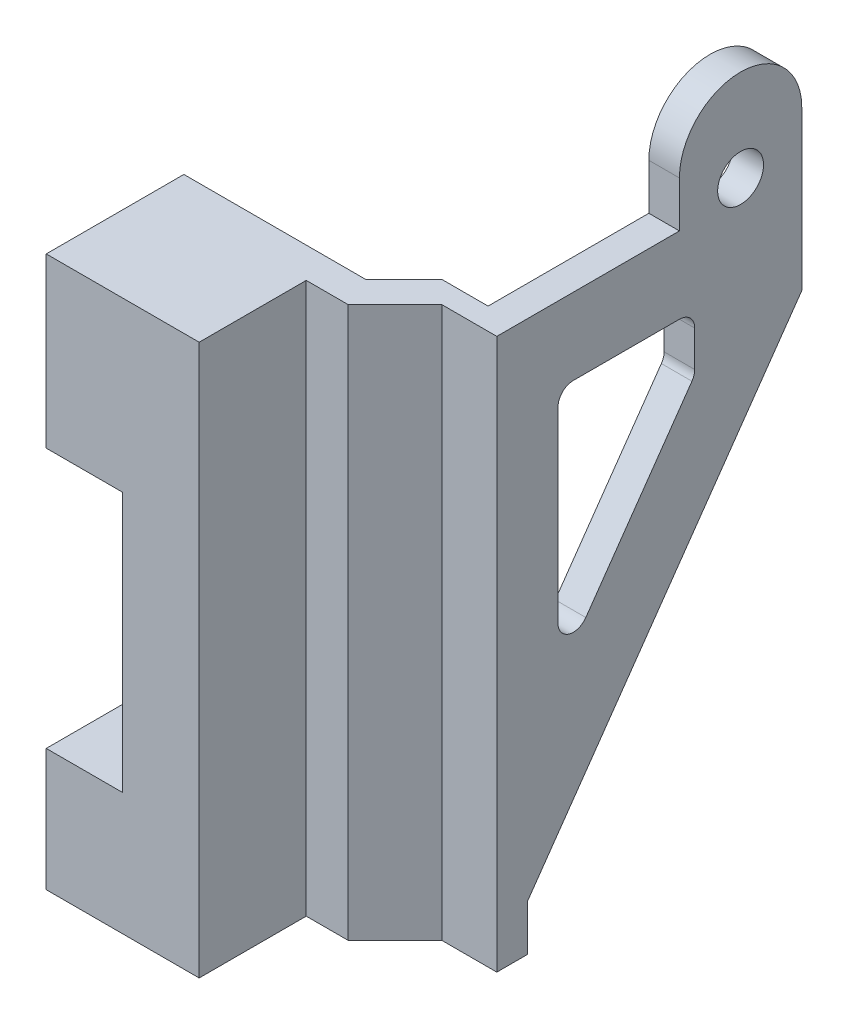
ISO-10303-21;
HEADER;
FILE_DESCRIPTION(('STEP AP214'),'2;1');
FILE_NAME('part.step','',(''),(''),'','','');
FILE_SCHEMA(('AUTOMOTIVE_DESIGN { 1 0 10303 214 1 1 1 1 }'));
ENDSEC;
DATA;
#1=APPLICATION_CONTEXT('core data for automotive mechanical design processes');
#2=APPLICATION_PROTOCOL_DEFINITION('international standard','automotive_design',2000,#1);
#3=PRODUCT_CONTEXT('',#1,'mechanical');
#4=PRODUCT('Part','Part','',(#3));
#5=PRODUCT_RELATED_PRODUCT_CATEGORY('part','',(#4));
#6=PRODUCT_DEFINITION_FORMATION('','',#4);
#7=PRODUCT_DEFINITION_CONTEXT('part definition',#1,'design');
#8=PRODUCT_DEFINITION('design','',#6,#7);
#9=PRODUCT_DEFINITION_SHAPE('','',#8);
#10=(LENGTH_UNIT() NAMED_UNIT(*) SI_UNIT(.MILLI.,.METRE.));
#11=(NAMED_UNIT(*) PLANE_ANGLE_UNIT() SI_UNIT($,.RADIAN.));
#12=(NAMED_UNIT(*) SI_UNIT($,.STERADIAN.) SOLID_ANGLE_UNIT());
#13=UNCERTAINTY_MEASURE_WITH_UNIT(LENGTH_MEASURE(1.E-05),#10,'distance_accuracy_value','');
#14=(GEOMETRIC_REPRESENTATION_CONTEXT(3) GLOBAL_UNCERTAINTY_ASSIGNED_CONTEXT((#13)) GLOBAL_UNIT_ASSIGNED_CONTEXT((#10,
#11,#12)) REPRESENTATION_CONTEXT('',''));
#15=CARTESIAN_POINT('',(0.,0.,0.));
#16=DIRECTION('',(0.,0.,1.));
#17=DIRECTION('',(1.,0.,0.));
#18=AXIS2_PLACEMENT_3D('',#15,#16,#17);
#19=CARTESIAN_POINT('',(0.,36.,0.));
#20=DIRECTION('',(1.,0.,0.));
#21=DIRECTION('',(0.,0.,-1.));
#22=AXIS2_PLACEMENT_3D('',#19,#20,#21);
#23=PLANE('',#22);
#24=DIRECTION('',(0.,-1.,0.));
#25=VECTOR('',#24,1.);
#26=CARTESIAN_POINT('',(0.,36.,9.));
#27=LINE('',#26,#25);
#28=CARTESIAN_POINT('',(0.,8.,9.));
#29=VERTEX_POINT('',#28);
#30=CARTESIAN_POINT('',(0.,0.,9.));
#31=VERTEX_POINT('',#30);
#32=EDGE_CURVE('E45',#29,#31,#27,.T.);
#33=ORIENTED_EDGE('',*,*,#32,.F.);
#34=DIRECTION('',(0.,0.,-1.));
#35=VECTOR('',#34,1.);
#36=CARTESIAN_POINT('',(0.,8.,9.001));
#37=LINE('',#36,#35);
#38=CARTESIAN_POINT('',(0.,8.,0.));
#39=VERTEX_POINT('',#38);
#40=EDGE_CURVE('E228',#29,#39,#37,.T.);
#41=ORIENTED_EDGE('',*,*,#40,.T.);
#42=DIRECTION('',(0.,-1.,0.));
#43=VECTOR('',#42,1.);
#44=CARTESIAN_POINT('',(0.,36.,0.));
#45=LINE('',#44,#43);
#46=CARTESIAN_POINT('',(0.,0.,0.));
#47=VERTEX_POINT('',#46);
#48=EDGE_CURVE('E276',#39,#47,#45,.T.);
#49=ORIENTED_EDGE('',*,*,#48,.T.);
#50=DIRECTION('',(0.,0.,1.));
#51=VECTOR('',#50,1.);
#52=CARTESIAN_POINT('',(0.,0.,0.));
#53=LINE('',#52,#51);
#54=EDGE_CURVE('E277',#47,#31,#53,.T.);
#55=ORIENTED_EDGE('',*,*,#54,.T.);
#56=EDGE_LOOP('',(#33,#41,#49,#55));
#57=FACE_BOUND('',#56,.T.);
#58=ADVANCED_FACE('F37',(#57),#23,.F.);
#59=CARTESIAN_POINT('',(0.,36.,0.));
#60=VERTEX_POINT('',#59);
#61=CARTESIAN_POINT('',(0.,25.,0.));
#62=VERTEX_POINT('',#61);
#63=EDGE_CURVE('E235',#60,#62,#45,.T.);
#64=ORIENTED_EDGE('',*,*,#63,.T.);
#65=DIRECTION('',(0.,0.,-1.));
#66=VECTOR('',#65,1.);
#67=CARTESIAN_POINT('',(0.,25.,9.001));
#68=LINE('',#67,#66);
#69=CARTESIAN_POINT('',(0.,25.,9.));
#70=VERTEX_POINT('',#69);
#71=EDGE_CURVE('E52',#70,#62,#68,.T.);
#72=ORIENTED_EDGE('',*,*,#71,.F.);
#73=CARTESIAN_POINT('',(0.,36.,9.));
#74=VERTEX_POINT('',#73);
#75=EDGE_CURVE('E11',#74,#70,#27,.T.);
#76=ORIENTED_EDGE('',*,*,#75,.F.);
#77=DIRECTION('',(0.,0.,1.));
#78=VECTOR('',#77,1.);
#79=CARTESIAN_POINT('',(0.,36.,0.));
#80=LINE('',#79,#78);
#81=EDGE_CURVE('E246',#60,#74,#80,.T.);
#82=ORIENTED_EDGE('',*,*,#81,.F.);
#83=EDGE_LOOP('',(#64,#72,#76,#82));
#84=FACE_BOUND('',#83,.T.);
#85=ADVANCED_FACE('F39',(#84),#23,.F.);
#86=CARTESIAN_POINT('',(0.,36.,9.));
#87=DIRECTION('',(0.,0.,-1.));
#88=DIRECTION('',(-1.,0.,0.));
#89=AXIS2_PLACEMENT_3D('',#86,#87,#88);
#90=PLANE('',#89);
#91=DIRECTION('',(0.,1.,0.));
#92=VECTOR('',#91,1.);
#93=CARTESIAN_POINT('',(5.,8.,9.));
#94=LINE('',#93,#92);
#95=CARTESIAN_POINT('',(5.,8.,9.));
#96=VERTEX_POINT('',#95);
#97=CARTESIAN_POINT('',(5.,25.,9.));
#98=VERTEX_POINT('',#97);
#99=EDGE_CURVE('E508',#96,#98,#94,.T.);
#100=ORIENTED_EDGE('',*,*,#99,.F.);
#101=DIRECTION('',(1.,0.,0.));
#102=VECTOR('',#101,1.);
#103=CARTESIAN_POINT('',(0.,8.,9.));
#104=LINE('',#103,#102);
#105=EDGE_CURVE('E332',#29,#96,#104,.T.);
#106=ORIENTED_EDGE('',*,*,#105,.F.);
#107=ORIENTED_EDGE('',*,*,#32,.T.);
#108=DIRECTION('',(1.,0.,0.));
#109=VECTOR('',#108,1.);
#110=CARTESIAN_POINT('',(0.,0.,9.));
#111=LINE('',#110,#109);
#112=CARTESIAN_POINT('',(10.,0.,9.));
#113=VERTEX_POINT('',#112);
#114=EDGE_CURVE('E280',#31,#113,#111,.T.);
#115=ORIENTED_EDGE('',*,*,#114,.T.);
#116=DIRECTION('',(0.,-1.,0.));
#117=VECTOR('',#116,1.);
#118=CARTESIAN_POINT('',(10.,36.,9.));
#119=LINE('',#118,#117);
#120=CARTESIAN_POINT('',(10.,36.,9.));
#121=VERTEX_POINT('',#120);
#122=EDGE_CURVE('E243',#121,#113,#119,.T.);
#123=ORIENTED_EDGE('',*,*,#122,.F.);
#124=DIRECTION('',(1.,0.,0.));
#125=VECTOR('',#124,1.);
#126=CARTESIAN_POINT('',(0.,36.,9.));
#127=LINE('',#126,#125);
#128=EDGE_CURVE('E240',#74,#121,#127,.T.);
#129=ORIENTED_EDGE('',*,*,#128,.F.);
#130=ORIENTED_EDGE('',*,*,#75,.T.);
#131=DIRECTION('',(-1.,0.,0.));
#132=VECTOR('',#131,1.);
#133=CARTESIAN_POINT('',(5.,25.,9.));
#134=LINE('',#133,#132);
#135=EDGE_CURVE('E221',#98,#70,#134,.T.);
#136=ORIENTED_EDGE('',*,*,#135,.F.);
#137=EDGE_LOOP('',(#100,#106,#107,#115,#123,#129,#130,#136));
#138=FACE_BOUND('',#137,.T.);
#139=ADVANCED_FACE('F238',(#138),#90,.F.);
#140=CARTESIAN_POINT('',(10.,36.,9.));
#141=DIRECTION('',(-1.,0.,0.));
#142=DIRECTION('',(0.,0.,1.));
#143=AXIS2_PLACEMENT_3D('',#140,#141,#142);
#144=PLANE('',#143);
#145=DIRECTION('',(0.,0.,-1.));
#146=VECTOR('',#145,1.);
#147=CARTESIAN_POINT('',(10.,0.,9.));
#148=LINE('',#147,#146);
#149=CARTESIAN_POINT('',(10.,0.,2.));
#150=VERTEX_POINT('',#149);
#151=EDGE_CURVE('E283',#113,#150,#148,.T.);
#152=ORIENTED_EDGE('',*,*,#151,.T.);
#153=DIRECTION('',(0.,-1.,0.));
#154=VECTOR('',#153,1.);
#155=CARTESIAN_POINT('',(10.,36.,2.));
#156=LINE('',#155,#154);
#157=CARTESIAN_POINT('',(10.,36.,2.));
#158=VERTEX_POINT('',#157);
#159=EDGE_CURVE('E324',#158,#150,#156,.T.);
#160=ORIENTED_EDGE('',*,*,#159,.F.);
#161=DIRECTION('',(0.,0.,-1.));
#162=VECTOR('',#161,1.);
#163=CARTESIAN_POINT('',(10.,36.,9.));
#164=LINE('',#163,#162);
#165=EDGE_CURVE('E245',#121,#158,#164,.T.);
#166=ORIENTED_EDGE('',*,*,#165,.F.);
#167=ORIENTED_EDGE('',*,*,#122,.T.);
#168=EDGE_LOOP('',(#152,#160,#166,#167));
#169=FACE_BOUND('',#168,.T.);
#170=ADVANCED_FACE('F391',(#169),#144,.F.);
#171=CARTESIAN_POINT('',(10.,36.,2.));
#172=DIRECTION('',(0.,0.,-1.));
#173=DIRECTION('',(-1.,0.,0.));
#174=AXIS2_PLACEMENT_3D('',#171,#172,#173);
#175=PLANE('',#174);
#176=DIRECTION('',(1.,0.,0.));
#177=VECTOR('',#176,1.);
#178=CARTESIAN_POINT('',(10.,0.,2.));
#179=LINE('',#178,#177);
#180=CARTESIAN_POINT('',(12.7380952380952,0.,2.));
#181=VERTEX_POINT('',#180);
#182=EDGE_CURVE('E285',#150,#181,#179,.T.);
#183=ORIENTED_EDGE('',*,*,#182,.T.);
#184=DIRECTION('',(0.,-1.,0.));
#185=VECTOR('',#184,1.);
#186=CARTESIAN_POINT('',(12.7380952380952,36.,2.));
#187=LINE('',#186,#185);
#188=CARTESIAN_POINT('',(12.7380952380952,36.,2.));
#189=VERTEX_POINT('',#188);
#190=EDGE_CURVE('E321',#189,#181,#187,.T.);
#191=ORIENTED_EDGE('',*,*,#190,.F.);
#192=DIRECTION('',(1.,0.,0.));
#193=VECTOR('',#192,1.);
#194=CARTESIAN_POINT('',(10.,36.,2.));
#195=LINE('',#194,#193);
#196=EDGE_CURVE('E261',#158,#189,#195,.T.);
#197=ORIENTED_EDGE('',*,*,#196,.F.);
#198=ORIENTED_EDGE('',*,*,#159,.T.);
#199=EDGE_LOOP('',(#183,#191,#197,#198));
#200=FACE_BOUND('',#199,.T.);
#201=ADVANCED_FACE('F389',(#200),#175,.F.);
#202=CARTESIAN_POINT('',(12.7380952380952,36.,2.));
#203=DIRECTION('',(-0.707106781186548,0.,-0.707106781186546));
#204=DIRECTION('',(-0.707106781186546,0.,0.707106781186549));
#205=AXIS2_PLACEMENT_3D('',#202,#203,#204);
#206=PLANE('',#205);
#207=DIRECTION('',(0.707106781186546,0.,-0.707106781186549));
#208=VECTOR('',#207,1.);
#209=CARTESIAN_POINT('',(12.7380952380952,0.,2.));
#210=LINE('',#209,#208);
#211=CARTESIAN_POINT('',(15.7993197278912,0.,-1.06122448979593));
#212=VERTEX_POINT('',#211);
#213=EDGE_CURVE('E287',#181,#212,#210,.T.);
#214=ORIENTED_EDGE('',*,*,#213,.T.);
#215=DIRECTION('',(0.,-1.,0.));
#216=VECTOR('',#215,1.);
#217=CARTESIAN_POINT('',(15.7993197278912,36.,-1.06122448979593));
#218=LINE('',#217,#216);
#219=CARTESIAN_POINT('',(15.7993197278912,36.,-1.06122448979593));
#220=VERTEX_POINT('',#219);
#221=EDGE_CURVE('E318',#220,#212,#218,.T.);
#222=ORIENTED_EDGE('',*,*,#221,.F.);
#223=DIRECTION('',(0.707106781186546,0.,-0.707106781186549));
#224=VECTOR('',#223,1.);
#225=CARTESIAN_POINT('',(12.7380952380952,36.,2.));
#226=LINE('',#225,#224);
#227=EDGE_CURVE('E263',#189,#220,#226,.T.);
#228=ORIENTED_EDGE('',*,*,#227,.F.);
#229=ORIENTED_EDGE('',*,*,#190,.T.);
#230=EDGE_LOOP('',(#214,#222,#228,#229));
#231=FACE_BOUND('',#230,.T.);
#232=ADVANCED_FACE('F384',(#231),#206,.F.);
#233=CARTESIAN_POINT('',(15.7993197278912,36.,-1.06122448979593));
#234=DIRECTION('',(0.,0.,-1.));
#235=DIRECTION('',(-1.,0.,0.));
#236=AXIS2_PLACEMENT_3D('',#233,#234,#235);
#237=PLANE('',#236);
#238=DIRECTION('',(1.,0.,0.));
#239=VECTOR('',#238,1.);
#240=CARTESIAN_POINT('',(15.7993197278912,0.,-1.06122448979593));
#241=LINE('',#240,#239);
#242=CARTESIAN_POINT('',(19.3993197278912,0.,-1.06122448979593));
#243=VERTEX_POINT('',#242);
#244=EDGE_CURVE('E289',#212,#243,#241,.T.);
#245=ORIENTED_EDGE('',*,*,#244,.T.);
#246=DIRECTION('',(0.,-1.,0.));
#247=VECTOR('',#246,1.);
#248=CARTESIAN_POINT('',(19.3993197278912,36.,-1.06122448979593));
#249=LINE('',#248,#247);
#250=CARTESIAN_POINT('',(19.3993197278912,36.,-1.06122448979593));
#251=VERTEX_POINT('',#250);
#252=EDGE_CURVE('E315',#251,#243,#249,.T.);
#253=ORIENTED_EDGE('',*,*,#252,.F.);
#254=DIRECTION('',(1.,0.,0.));
#255=VECTOR('',#254,1.);
#256=CARTESIAN_POINT('',(15.7993197278912,36.,-1.06122448979593));
#257=LINE('',#256,#255);
#258=EDGE_CURVE('E265',#220,#251,#257,.T.);
#259=ORIENTED_EDGE('',*,*,#258,.F.);
#260=ORIENTED_EDGE('',*,*,#221,.T.);
#261=EDGE_LOOP('',(#245,#253,#259,#260));
#262=FACE_BOUND('',#261,.T.);
#263=ADVANCED_FACE('F380',(#262),#237,.F.);
#264=CARTESIAN_POINT('',(19.3993197278912,36.,-1.06122448979593));
#265=DIRECTION('',(-1.,0.,0.));
#266=DIRECTION('',(0.,0.,1.));
#267=AXIS2_PLACEMENT_3D('',#264,#265,#266);
#268=PLANE('',#267);
#269=CARTESIAN_POINT('',(19.3993197278912,37.,-17.));
#270=DIRECTION('',(1.,0.,0.));
#271=DIRECTION('',(0.,0.,-1.));
#272=AXIS2_PLACEMENT_3D('',#269,#270,#271);
#273=CIRCLE('',#272,1.5);
#274=CARTESIAN_POINT('',(19.3993197278912,37.,-18.5));
#275=VERTEX_POINT('',#274);
#276=EDGE_CURVE('E227',#275,#275,#273,.T.);
#277=ORIENTED_EDGE('',*,*,#276,.F.);
#278=EDGE_LOOP('',(#277));
#279=FACE_BOUND('',#278,.T.);
#280=DIRECTION('',(0.,0.819152044288991,-0.573576436351047));
#281=VECTOR('',#280,1.);
#282=CARTESIAN_POINT('',(19.3993197278912,27.0811467717307,-13.819152044289));
#283=LINE('',#282,#281);
#284=CARTESIAN_POINT('',(19.3993197278912,17.1715483576019,-6.88037653408495));
#285=VERTEX_POINT('',#284);
#286=CARTESIAN_POINT('',(19.3993197278912,27.0811467717307,-13.819152044289));
#287=VERTEX_POINT('',#286);
#288=EDGE_CURVE('E436',#285,#287,#283,.T.);
#289=ORIENTED_EDGE('',*,*,#288,.F.);
#290=CARTESIAN_POINT('',(19.3993197278912,17.7451247939529,-6.06122448979593));
#291=DIRECTION('',(1.,0.,0.));
#292=DIRECTION('',(0.,0.,-1.));
#293=AXIS2_PLACEMENT_3D('',#290,#291,#292);
#294=CIRCLE('',#293,1.);
#295=CARTESIAN_POINT('',(19.3993197278912,17.7451247939529,-5.06122448979593));
#296=VERTEX_POINT('',#295);
#297=EDGE_CURVE('E434',#296,#285,#294,.T.);
#298=ORIENTED_EDGE('',*,*,#297,.F.);
#299=DIRECTION('',(0.,-1.,0.));
#300=VECTOR('',#299,1.);
#301=CARTESIAN_POINT('',(19.3993197278912,17.7451247939529,-5.06122448979593));
#302=LINE('',#301,#300);
#303=CARTESIAN_POINT('',(19.3993197278912,30.,-5.06122448979593));
#304=VERTEX_POINT('',#303);
#305=EDGE_CURVE('E454',#304,#296,#302,.T.);
#306=ORIENTED_EDGE('',*,*,#305,.F.);
#307=CARTESIAN_POINT('',(19.3993197278912,30.,-6.06122448979593));
#308=DIRECTION('',(1.,0.,0.));
#309=DIRECTION('',(0.,0.,1.));
#310=AXIS2_PLACEMENT_3D('',#307,#308,#309);
#311=CIRCLE('',#310,1.);
#312=CARTESIAN_POINT('',(19.3993197278912,31.,-6.06122448979594));
#313=VERTEX_POINT('',#312);
#314=EDGE_CURVE('E451',#313,#304,#311,.T.);
#315=ORIENTED_EDGE('',*,*,#314,.F.);
#316=DIRECTION('',(0.,0.,1.));
#317=VECTOR('',#316,1.);
#318=CARTESIAN_POINT('',(19.3993197278912,31.,-6.06122448979594));
#319=LINE('',#318,#317);
#320=CARTESIAN_POINT('',(19.3993197278912,31.,-13.));
#321=VERTEX_POINT('',#320);
#322=EDGE_CURVE('E448',#321,#313,#319,.T.);
#323=ORIENTED_EDGE('',*,*,#322,.F.);
#324=CARTESIAN_POINT('',(19.3993197278912,30.,-13.));
#325=DIRECTION('',(1.,0.,0.));
#326=DIRECTION('',(0.,0.,1.));
#327=AXIS2_PLACEMENT_3D('',#324,#325,#326);
#328=CIRCLE('',#327,1.);
#329=CARTESIAN_POINT('',(19.3993197278912,30.,-14.));
#330=VERTEX_POINT('',#329);
#331=EDGE_CURVE('E445',#330,#321,#328,.T.);
#332=ORIENTED_EDGE('',*,*,#331,.F.);
#333=DIRECTION('',(0.,1.,0.));
#334=VECTOR('',#333,1.);
#335=CARTESIAN_POINT('',(19.3993197278912,30.,-14.));
#336=LINE('',#335,#334);
#337=CARTESIAN_POINT('',(19.3993197278912,27.6547232080818,-14.));
#338=VERTEX_POINT('',#337);
#339=EDGE_CURVE('E442',#338,#330,#336,.T.);
#340=ORIENTED_EDGE('',*,*,#339,.F.);
#341=CARTESIAN_POINT('',(19.3993197278912,27.6547232080818,-13.));
#342=DIRECTION('',(1.,0.,0.));
#343=DIRECTION('',(0.,0.,1.));
#344=AXIS2_PLACEMENT_3D('',#341,#342,#343);
#345=CIRCLE('',#344,1.);
#346=EDGE_CURVE('E439',#287,#338,#345,.T.);
#347=ORIENTED_EDGE('',*,*,#346,.F.);
#348=EDGE_LOOP('',(#289,#298,#306,#315,#323,#332,#340,#347));
#349=FACE_BOUND('',#348,.T.);
#350=DIRECTION('',(0.,0.,-1.));
#351=VECTOR('',#350,1.);
#352=CARTESIAN_POINT('',(19.3993197278912,0.,-1.06122448979593));
#353=LINE('',#352,#351);
#354=CARTESIAN_POINT('',(19.3993197278912,0.,-3.06122448979593));
#355=VERTEX_POINT('',#354);
#356=EDGE_CURVE('E291',#243,#355,#353,.T.);
#357=ORIENTED_EDGE('',*,*,#356,.T.);
#358=DIRECTION('',(0.,-1.,0.));
#359=VECTOR('',#358,1.);
#360=CARTESIAN_POINT('',(19.3993197278912,0.,-3.06122448979593));
#361=LINE('',#360,#359);
#362=CARTESIAN_POINT('',(19.3993197278912,3.,-3.06122448979593));
#363=VERTEX_POINT('',#362);
#364=EDGE_CURVE('E374',#363,#355,#361,.T.);
#365=ORIENTED_EDGE('',*,*,#364,.F.);
#366=DIRECTION('',(0.,-0.819152044288991,0.573576436351047));
#367=VECTOR('',#366,1.);
#368=CARTESIAN_POINT('',(19.3993197278912,3.,-3.06122448979593));
#369=LINE('',#368,#367);
#370=CARTESIAN_POINT('',(19.3993197278912,28.6192264882921,-21.));
#371=VERTEX_POINT('',#370);
#372=EDGE_CURVE('E480',#371,#363,#369,.T.);
#373=ORIENTED_EDGE('',*,*,#372,.F.);
#374=DIRECTION('',(0.,-1.,0.));
#375=VECTOR('',#374,1.);
#376=CARTESIAN_POINT('',(19.3993197278912,36.,-21.));
#377=LINE('',#376,#375);
#378=CARTESIAN_POINT('',(19.3993197278912,39.,-21.));
#379=VERTEX_POINT('',#378);
#380=EDGE_CURVE('E312',#379,#371,#377,.T.);
#381=ORIENTED_EDGE('',*,*,#380,.F.);
#382=CARTESIAN_POINT('',(19.3993197278912,39.,-17.));
#383=DIRECTION('',(1.,0.,0.));
#384=DIRECTION('',(0.,0.,-1.));
#385=AXIS2_PLACEMENT_3D('',#382,#383,#384);
#386=CIRCLE('',#385,4.);
#387=CARTESIAN_POINT('',(19.3993197278912,39.,-13.));
#388=VERTEX_POINT('',#387);
#389=EDGE_CURVE('E402',#379,#388,#386,.T.);
#390=ORIENTED_EDGE('',*,*,#389,.T.);
#391=DIRECTION('',(0.,-1.,0.));
#392=VECTOR('',#391,1.);
#393=CARTESIAN_POINT('',(19.3993197278912,36.,-13.));
#394=LINE('',#393,#392);
#395=CARTESIAN_POINT('',(19.3993197278912,36.,-13.));
#396=VERTEX_POINT('',#395);
#397=EDGE_CURVE('E395',#388,#396,#394,.T.);
#398=ORIENTED_EDGE('',*,*,#397,.T.);
#399=DIRECTION('',(0.,0.,-1.));
#400=VECTOR('',#399,1.);
#401=CARTESIAN_POINT('',(19.3993197278912,36.,-1.06122448979593));
#402=LINE('',#401,#400);
#403=EDGE_CURVE('E267',#251,#396,#402,.T.);
#404=ORIENTED_EDGE('',*,*,#403,.F.);
#405=ORIENTED_EDGE('',*,*,#252,.T.);
#406=EDGE_LOOP('',(#357,#365,#373,#381,#390,#398,#404,#405));
#407=FACE_BOUND('',#406,.T.);
#408=ADVANCED_FACE('F372',(#279,#349,#407),#268,.F.);
#409=CARTESIAN_POINT('',(19.3993197278912,36.,-21.));
#410=DIRECTION('',(0.,0.,1.));
#411=DIRECTION('',(1.,0.,0.));
#412=AXIS2_PLACEMENT_3D('',#409,#410,#411);
#413=PLANE('',#412);
#414=ORIENTED_EDGE('',*,*,#380,.T.);
#415=DIRECTION('',(1.,0.,0.));
#416=VECTOR('',#415,1.);
#417=CARTESIAN_POINT('',(-0.00100000000000794,28.6192264882921,-21.));
#418=LINE('',#417,#416);
#419=CARTESIAN_POINT('',(17.3993197278912,28.6192264882921,-21.));
#420=VERTEX_POINT('',#419);
#421=EDGE_CURVE('E257',#420,#371,#418,.T.);
#422=ORIENTED_EDGE('',*,*,#421,.F.);
#423=DIRECTION('',(0.,-1.,0.));
#424=VECTOR('',#423,1.);
#425=CARTESIAN_POINT('',(17.3993197278912,36.,-21.));
#426=LINE('',#425,#424);
#427=CARTESIAN_POINT('',(17.3993197278912,39.,-21.));
#428=VERTEX_POINT('',#427);
#429=EDGE_CURVE('E309',#428,#420,#426,.T.);
#430=ORIENTED_EDGE('',*,*,#429,.F.);
#431=DIRECTION('',(1.,0.,0.));
#432=VECTOR('',#431,1.);
#433=CARTESIAN_POINT('',(17.3993197278912,39.,-21.));
#434=LINE('',#433,#432);
#435=EDGE_CURVE('E398',#428,#379,#434,.T.);
#436=ORIENTED_EDGE('',*,*,#435,.T.);
#437=EDGE_LOOP('',(#414,#422,#430,#436));
#438=FACE_BOUND('',#437,.T.);
#439=ADVANCED_FACE('F487',(#438),#413,.F.);
#440=CARTESIAN_POINT('',(17.3993197278912,36.,-2.48965161454213));
#441=DIRECTION('',(1.,0.,0.));
#442=DIRECTION('',(0.,0.,-1.));
#443=AXIS2_PLACEMENT_3D('',#440,#441,#442);
#444=PLANE('',#443);
#445=CARTESIAN_POINT('',(17.3993197278912,37.,-17.));
#446=DIRECTION('',(1.,0.,0.));
#447=DIRECTION('',(0.,0.,-1.));
#448=AXIS2_PLACEMENT_3D('',#445,#446,#447);
#449=CIRCLE('',#448,1.5);
#450=CARTESIAN_POINT('',(17.3993197278912,37.,-18.5));
#451=VERTEX_POINT('',#450);
#452=EDGE_CURVE('E407',#451,#451,#449,.F.);
#453=ORIENTED_EDGE('',*,*,#452,.F.);
#454=EDGE_LOOP('',(#453));
#455=FACE_BOUND('',#454,.T.);
#456=DIRECTION('',(0.,1.,0.));
#457=VECTOR('',#456,1.);
#458=CARTESIAN_POINT('',(17.3993197278912,17.7451247939529,-5.06122448979593));
#459=LINE('',#458,#457);
#460=CARTESIAN_POINT('',(17.3993197278912,17.7451247939529,-5.06122448979593));
#461=VERTEX_POINT('',#460);
#462=CARTESIAN_POINT('',(17.3993197278912,30.,-5.06122448979593));
#463=VERTEX_POINT('',#462);
#464=EDGE_CURVE('E428',#461,#463,#459,.T.);
#465=ORIENTED_EDGE('',*,*,#464,.F.);
#466=CARTESIAN_POINT('',(17.3993197278912,17.7451247939529,-6.06122448979593));
#467=DIRECTION('',(1.,0.,0.));
#468=DIRECTION('',(0.,0.,-1.));
#469=AXIS2_PLACEMENT_3D('',#466,#467,#468);
#470=CIRCLE('',#469,1.);
#471=CARTESIAN_POINT('',(17.3993197278912,17.1715483576019,-6.88037653408494));
#472=VERTEX_POINT('',#471);
#473=EDGE_CURVE('E431',#472,#461,#470,.F.);
#474=ORIENTED_EDGE('',*,*,#473,.F.);
#475=DIRECTION('',(0.,-0.819152044288991,0.573576436351047));
#476=VECTOR('',#475,1.);
#477=CARTESIAN_POINT('',(17.3993197278912,27.0811467717307,-13.819152044289));
#478=LINE('',#477,#476);
#479=CARTESIAN_POINT('',(17.3993197278912,27.0811467717307,-13.819152044289));
#480=VERTEX_POINT('',#479);
#481=EDGE_CURVE('E460',#480,#472,#478,.T.);
#482=ORIENTED_EDGE('',*,*,#481,.F.);
#483=CARTESIAN_POINT('',(17.3993197278912,27.6547232080818,-13.));
#484=DIRECTION('',(1.,0.,0.));
#485=DIRECTION('',(0.,0.,-1.));
#486=AXIS2_PLACEMENT_3D('',#483,#484,#485);
#487=CIRCLE('',#486,1.);
#488=CARTESIAN_POINT('',(17.3993197278912,27.6547232080818,-14.));
#489=VERTEX_POINT('',#488);
#490=EDGE_CURVE('E412',#489,#480,#487,.F.);
#491=ORIENTED_EDGE('',*,*,#490,.F.);
#492=DIRECTION('',(0.,-1.,0.));
#493=VECTOR('',#492,1.);
#494=CARTESIAN_POINT('',(17.3993197278912,30.,-14.));
#495=LINE('',#494,#493);
#496=CARTESIAN_POINT('',(17.3993197278912,30.,-14.));
#497=VERTEX_POINT('',#496);
#498=EDGE_CURVE('E416',#497,#489,#495,.T.);
#499=ORIENTED_EDGE('',*,*,#498,.F.);
#500=CARTESIAN_POINT('',(17.3993197278912,30.,-13.));
#501=DIRECTION('',(1.,0.,0.));
#502=DIRECTION('',(0.,0.,-1.));
#503=AXIS2_PLACEMENT_3D('',#500,#501,#502);
#504=CIRCLE('',#503,1.);
#505=CARTESIAN_POINT('',(17.3993197278912,31.,-13.));
#506=VERTEX_POINT('',#505);
#507=EDGE_CURVE('E419',#506,#497,#504,.F.);
#508=ORIENTED_EDGE('',*,*,#507,.F.);
#509=DIRECTION('',(0.,0.,-1.));
#510=VECTOR('',#509,1.);
#511=CARTESIAN_POINT('',(17.3993197278912,31.,-6.06122448979594));
#512=LINE('',#511,#510);
#513=CARTESIAN_POINT('',(17.3993197278912,31.,-6.06122448979594));
#514=VERTEX_POINT('',#513);
#515=EDGE_CURVE('E422',#514,#506,#512,.T.);
#516=ORIENTED_EDGE('',*,*,#515,.F.);
#517=CARTESIAN_POINT('',(17.3993197278912,30.,-6.06122448979593));
#518=DIRECTION('',(1.,0.,0.));
#519=DIRECTION('',(0.,0.,-1.));
#520=AXIS2_PLACEMENT_3D('',#517,#518,#519);
#521=CIRCLE('',#520,1.);
#522=EDGE_CURVE('E425',#463,#514,#521,.F.);
#523=ORIENTED_EDGE('',*,*,#522,.F.);
#524=EDGE_LOOP('',(#465,#474,#482,#491,#499,#508,#516,#523));
#525=FACE_BOUND('',#524,.T.);
#526=DIRECTION('',(0.,0.819152044288991,-0.573576436351047));
#527=VECTOR('',#526,1.);
#528=CARTESIAN_POINT('',(17.3993197278912,3.,-3.06122448979593));
#529=LINE('',#528,#527);
#530=CARTESIAN_POINT('',(17.3993197278912,3.,-3.06122448979593));
#531=VERTEX_POINT('',#530);
#532=EDGE_CURVE('E477',#531,#420,#529,.T.);
#533=ORIENTED_EDGE('',*,*,#532,.F.);
#534=DIRECTION('',(0.,1.,0.));
#535=VECTOR('',#534,1.);
#536=CARTESIAN_POINT('',(17.3993197278912,0.,-3.06122448979593));
#537=LINE('',#536,#535);
#538=CARTESIAN_POINT('',(17.3993197278912,0.,-3.06122448979593));
#539=VERTEX_POINT('',#538);
#540=EDGE_CURVE('E363',#539,#531,#537,.T.);
#541=ORIENTED_EDGE('',*,*,#540,.F.);
#542=DIRECTION('',(0.,0.,1.));
#543=VECTOR('',#542,1.);
#544=CARTESIAN_POINT('',(17.3993197278912,0.,-2.48965161454213));
#545=LINE('',#544,#543);
#546=CARTESIAN_POINT('',(17.3993197278912,0.,-2.48965161454213));
#547=VERTEX_POINT('',#546);
#548=EDGE_CURVE('E294',#539,#547,#545,.T.);
#549=ORIENTED_EDGE('',*,*,#548,.T.);
#550=DIRECTION('',(0.,-1.,0.));
#551=VECTOR('',#550,1.);
#552=CARTESIAN_POINT('',(17.3993197278912,36.,-2.48965161454213));
#553=LINE('',#552,#551);
#554=CARTESIAN_POINT('',(17.3993197278912,36.,-2.48965161454213));
#555=VERTEX_POINT('',#554);
#556=EDGE_CURVE('E306',#555,#547,#553,.T.);
#557=ORIENTED_EDGE('',*,*,#556,.F.);
#558=DIRECTION('',(0.,0.,1.));
#559=VECTOR('',#558,1.);
#560=CARTESIAN_POINT('',(17.3993197278912,36.,-2.48965161454213));
#561=LINE('',#560,#559);
#562=CARTESIAN_POINT('',(17.3993197278912,36.,-13.));
#563=VERTEX_POINT('',#562);
#564=EDGE_CURVE('E269',#563,#555,#561,.T.);
#565=ORIENTED_EDGE('',*,*,#564,.F.);
#566=DIRECTION('',(0.,-1.,0.));
#567=VECTOR('',#566,1.);
#568=CARTESIAN_POINT('',(17.3993197278912,36.,-13.));
#569=LINE('',#568,#567);
#570=CARTESIAN_POINT('',(17.3993197278912,39.,-13.));
#571=VERTEX_POINT('',#570);
#572=EDGE_CURVE('E397',#571,#563,#569,.T.);
#573=ORIENTED_EDGE('',*,*,#572,.F.);
#574=CARTESIAN_POINT('',(17.3993197278912,39.,-17.));
#575=DIRECTION('',(1.,0.,0.));
#576=DIRECTION('',(0.,0.,-1.));
#577=AXIS2_PLACEMENT_3D('',#574,#575,#576);
#578=CIRCLE('',#577,4.);
#579=EDGE_CURVE('E403',#428,#571,#578,.T.);
#580=ORIENTED_EDGE('',*,*,#579,.F.);
#581=ORIENTED_EDGE('',*,*,#429,.T.);
#582=EDGE_LOOP('',(#533,#541,#549,#557,#565,#573,#580,#581));
#583=FACE_BOUND('',#582,.T.);
#584=ADVANCED_FACE('F358',(#455,#525,#583),#444,.F.);
#585=CARTESIAN_POINT('',(14.3993197278912,36.,-2.48965161454213));
#586=DIRECTION('',(0.,0.,1.));
#587=DIRECTION('',(1.,0.,0.));
#588=AXIS2_PLACEMENT_3D('',#585,#586,#587);
#589=PLANE('',#588);
#590=DIRECTION('',(-1.,0.,0.));
#591=VECTOR('',#590,1.);
#592=CARTESIAN_POINT('',(14.3993197278912,0.,-2.48965161454213));
#593=LINE('',#592,#591);
#594=CARTESIAN_POINT('',(14.3993197278912,0.,-2.48965161454213));
#595=VERTEX_POINT('',#594);
#596=EDGE_CURVE('E296',#547,#595,#593,.T.);
#597=ORIENTED_EDGE('',*,*,#596,.T.);
#598=DIRECTION('',(0.,-1.,0.));
#599=VECTOR('',#598,1.);
#600=CARTESIAN_POINT('',(14.3993197278912,36.,-2.48965161454213));
#601=LINE('',#600,#599);
#602=CARTESIAN_POINT('',(14.3993197278912,36.,-2.48965161454213));
#603=VERTEX_POINT('',#602);
#604=EDGE_CURVE('E303',#603,#595,#601,.T.);
#605=ORIENTED_EDGE('',*,*,#604,.F.);
#606=DIRECTION('',(-1.,0.,0.));
#607=VECTOR('',#606,1.);
#608=CARTESIAN_POINT('',(14.3993197278912,36.,-2.48965161454213));
#609=LINE('',#608,#607);
#610=EDGE_CURVE('E271',#555,#603,#609,.T.);
#611=ORIENTED_EDGE('',*,*,#610,.F.);
#612=ORIENTED_EDGE('',*,*,#556,.T.);
#613=EDGE_LOOP('',(#597,#605,#611,#612));
#614=FACE_BOUND('',#613,.T.);
#615=ADVANCED_FACE('F354',(#614),#589,.F.);
#616=CARTESIAN_POINT('',(11.909668113349,36.,0.));
#617=DIRECTION('',(0.707106781186549,0.,0.707106781186546));
#618=DIRECTION('',(0.707106781186546,0.,-0.707106781186549));
#619=AXIS2_PLACEMENT_3D('',#616,#617,#618);
#620=PLANE('',#619);
#621=DIRECTION('',(-0.707106781186546,0.,0.707106781186549));
#622=VECTOR('',#621,1.);
#623=CARTESIAN_POINT('',(11.909668113349,0.,0.));
#624=LINE('',#623,#622);
#625=CARTESIAN_POINT('',(11.909668113349,0.,0.));
#626=VERTEX_POINT('',#625);
#627=EDGE_CURVE('E254',#595,#626,#624,.T.);
#628=ORIENTED_EDGE('',*,*,#627,.T.);
#629=DIRECTION('',(0.,-1.,0.));
#630=VECTOR('',#629,1.);
#631=CARTESIAN_POINT('',(11.909668113349,36.,0.));
#632=LINE('',#631,#630);
#633=CARTESIAN_POINT('',(11.909668113349,36.,0.));
#634=VERTEX_POINT('',#633);
#635=EDGE_CURVE('E300',#634,#626,#632,.T.);
#636=ORIENTED_EDGE('',*,*,#635,.F.);
#637=DIRECTION('',(-0.707106781186546,0.,0.707106781186549));
#638=VECTOR('',#637,1.);
#639=CARTESIAN_POINT('',(11.909668113349,36.,0.));
#640=LINE('',#639,#638);
#641=EDGE_CURVE('E273',#603,#634,#640,.T.);
#642=ORIENTED_EDGE('',*,*,#641,.F.);
#643=ORIENTED_EDGE('',*,*,#604,.T.);
#644=EDGE_LOOP('',(#628,#636,#642,#643));
#645=FACE_BOUND('',#644,.T.);
#646=ADVANCED_FACE('F349',(#645),#620,.F.);
#647=CARTESIAN_POINT('',(0.,36.,0.));
#648=DIRECTION('',(0.,0.,1.));
#649=DIRECTION('',(1.,0.,0.));
#650=AXIS2_PLACEMENT_3D('',#647,#648,#649);
#651=PLANE('',#650);
#652=ORIENTED_EDGE('',*,*,#48,.F.);
#653=DIRECTION('',(-1.,0.,0.));
#654=VECTOR('',#653,1.);
#655=CARTESIAN_POINT('',(0.,8.,0.));
#656=LINE('',#655,#654);
#657=CARTESIAN_POINT('',(5.,8.,0.));
#658=VERTEX_POINT('',#657);
#659=EDGE_CURVE('E236',#658,#39,#656,.T.);
#660=ORIENTED_EDGE('',*,*,#659,.F.);
#661=DIRECTION('',(0.,-1.,0.));
#662=VECTOR('',#661,1.);
#663=CARTESIAN_POINT('',(5.,8.,0.));
#664=LINE('',#663,#662);
#665=CARTESIAN_POINT('',(5.,25.,0.));
#666=VERTEX_POINT('',#665);
#667=EDGE_CURVE('E502',#666,#658,#664,.T.);
#668=ORIENTED_EDGE('',*,*,#667,.F.);
#669=DIRECTION('',(1.,0.,0.));
#670=VECTOR('',#669,1.);
#671=CARTESIAN_POINT('',(5.,25.,0.));
#672=LINE('',#671,#670);
#673=EDGE_CURVE('E505',#62,#666,#672,.T.);
#674=ORIENTED_EDGE('',*,*,#673,.F.);
#675=ORIENTED_EDGE('',*,*,#63,.F.);
#676=DIRECTION('',(-1.,0.,0.));
#677=VECTOR('',#676,1.);
#678=CARTESIAN_POINT('',(0.,36.,0.));
#679=LINE('',#678,#677);
#680=EDGE_CURVE('E250',#634,#60,#679,.T.);
#681=ORIENTED_EDGE('',*,*,#680,.F.);
#682=ORIENTED_EDGE('',*,*,#635,.T.);
#683=DIRECTION('',(-1.,0.,0.));
#684=VECTOR('',#683,1.);
#685=CARTESIAN_POINT('',(0.,0.,0.));
#686=LINE('',#685,#684);
#687=EDGE_CURVE('E251',#626,#47,#686,.T.);
#688=ORIENTED_EDGE('',*,*,#687,.T.);
#689=EDGE_LOOP('',(#652,#660,#668,#674,#675,#681,#682,#688));
#690=FACE_BOUND('',#689,.T.);
#691=ADVANCED_FACE('F344',(#690),#651,.F.);
#692=CARTESIAN_POINT('',(0.,36.,0.));
#693=DIRECTION('',(0.,1.,0.));
#694=DIRECTION('',(0.,0.,1.));
#695=AXIS2_PLACEMENT_3D('',#692,#693,#694);
#696=PLANE('',#695);
#697=DIRECTION('',(1.,0.,0.));
#698=VECTOR('',#697,1.);
#699=CARTESIAN_POINT('',(17.3993197278912,36.,-13.));
#700=LINE('',#699,#698);
#701=EDGE_CURVE('E60',#563,#396,#700,.T.);
#702=ORIENTED_EDGE('',*,*,#701,.F.);
#703=ORIENTED_EDGE('',*,*,#564,.T.);
#704=ORIENTED_EDGE('',*,*,#610,.T.);
#705=ORIENTED_EDGE('',*,*,#641,.T.);
#706=ORIENTED_EDGE('',*,*,#680,.T.);
#707=ORIENTED_EDGE('',*,*,#81,.T.);
#708=ORIENTED_EDGE('',*,*,#128,.T.);
#709=ORIENTED_EDGE('',*,*,#165,.T.);
#710=ORIENTED_EDGE('',*,*,#196,.T.);
#711=ORIENTED_EDGE('',*,*,#227,.T.);
#712=ORIENTED_EDGE('',*,*,#258,.T.);
#713=ORIENTED_EDGE('',*,*,#403,.T.);
#714=EDGE_LOOP('',(#702,#703,#704,#705,#706,#707,#708,#709,#710,#711,#712,#713));
#715=FACE_BOUND('',#714,.T.);
#716=ADVANCED_FACE('F248',(#715),#696,.T.);
#717=CARTESIAN_POINT('',(0.,0.,0.));
#718=DIRECTION('',(0.,1.,0.));
#719=DIRECTION('',(0.,0.,1.));
#720=AXIS2_PLACEMENT_3D('',#717,#718,#719);
#721=PLANE('',#720);
#722=ORIENTED_EDGE('',*,*,#548,.F.);
#723=DIRECTION('',(1.,0.,0.));
#724=VECTOR('',#723,1.);
#725=CARTESIAN_POINT('',(-0.00100000000000447,0.,-3.06122448979593));
#726=LINE('',#725,#724);
#727=EDGE_CURVE('E281',#539,#355,#726,.T.);
#728=ORIENTED_EDGE('',*,*,#727,.T.);
#729=ORIENTED_EDGE('',*,*,#356,.F.);
#730=ORIENTED_EDGE('',*,*,#244,.F.);
#731=ORIENTED_EDGE('',*,*,#213,.F.);
#732=ORIENTED_EDGE('',*,*,#182,.F.);
#733=ORIENTED_EDGE('',*,*,#151,.F.);
#734=ORIENTED_EDGE('',*,*,#114,.F.);
#735=ORIENTED_EDGE('',*,*,#54,.F.);
#736=ORIENTED_EDGE('',*,*,#687,.F.);
#737=ORIENTED_EDGE('',*,*,#627,.F.);
#738=ORIENTED_EDGE('',*,*,#596,.F.);
#739=EDGE_LOOP('',(#722,#728,#729,#730,#731,#732,#733,#734,#735,#736,#737,#738));
#740=FACE_BOUND('',#739,.T.);
#741=ADVANCED_FACE('F338',(#740),#721,.F.);
#742=CARTESIAN_POINT('',(-0.00100000000000447,0.,-3.06122448979593));
#743=DIRECTION('',(0.,0.,1.));
#744=DIRECTION('',(1.,0.,0.));
#745=AXIS2_PLACEMENT_3D('',#742,#743,#744);
#746=PLANE('',#745);
#747=ORIENTED_EDGE('',*,*,#540,.T.);
#748=DIRECTION('',(1.,0.,0.));
#749=VECTOR('',#748,1.);
#750=CARTESIAN_POINT('',(-0.00100000000000447,3.,-3.06122448979593));
#751=LINE('',#750,#749);
#752=EDGE_CURVE('E368',#531,#363,#751,.T.);
#753=ORIENTED_EDGE('',*,*,#752,.T.);
#754=ORIENTED_EDGE('',*,*,#364,.T.);
#755=ORIENTED_EDGE('',*,*,#727,.F.);
#756=EDGE_LOOP('',(#747,#753,#754,#755));
#757=FACE_BOUND('',#756,.T.);
#758=ADVANCED_FACE('F559',(#757),#746,.F.);
#759=CARTESIAN_POINT('',(-0.00100000000000447,3.,-3.06122448979593));
#760=DIRECTION('',(0.,0.573576436351047,0.819152044288991));
#761=DIRECTION('',(0.,-0.819152044288991,0.573576436351047));
#762=AXIS2_PLACEMENT_3D('',#759,#760,#761);
#763=PLANE('',#762);
#764=ORIENTED_EDGE('',*,*,#532,.T.);
#765=ORIENTED_EDGE('',*,*,#421,.T.);
#766=ORIENTED_EDGE('',*,*,#372,.T.);
#767=ORIENTED_EDGE('',*,*,#752,.F.);
#768=EDGE_LOOP('',(#764,#765,#766,#767));
#769=FACE_BOUND('',#768,.T.);
#770=ADVANCED_FACE('F485',(#769),#763,.F.);
#771=CARTESIAN_POINT('',(-0.00100000000000447,17.7451247939529,-6.06122448979593));
#772=DIRECTION('',(1.,0.,0.));
#773=DIRECTION('',(0.,0.,-1.));
#774=AXIS2_PLACEMENT_3D('',#771,#772,#773);
#775=CYLINDRICAL_SURFACE('',#774,1.);
#776=ORIENTED_EDGE('',*,*,#473,.T.);
#777=DIRECTION('',(1.,0.,0.));
#778=VECTOR('',#777,1.);
#779=CARTESIAN_POINT('',(-0.00100000000000447,17.7451247939529,-5.06122448979593));
#780=LINE('',#779,#778);
#781=EDGE_CURVE('E458',#461,#296,#780,.T.);
#782=ORIENTED_EDGE('',*,*,#781,.T.);
#783=ORIENTED_EDGE('',*,*,#297,.T.);
#784=DIRECTION('',(1.,0.,0.));
#785=VECTOR('',#784,1.);
#786=CARTESIAN_POINT('',(-0.00100000000000447,17.1715483576019,-6.88037653408494));
#787=LINE('',#786,#785);
#788=EDGE_CURVE('E457',#472,#285,#787,.T.);
#789=ORIENTED_EDGE('',*,*,#788,.F.);
#790=EDGE_LOOP('',(#776,#782,#783,#789));
#791=FACE_BOUND('',#790,.T.);
#792=ADVANCED_FACE('F564',(#791),#775,.F.);
#793=CARTESIAN_POINT('',(-0.00100000000000447,17.7451247939529,-5.06122448979593));
#794=DIRECTION('',(0.,0.,1.));
#795=DIRECTION('',(1.,0.,0.));
#796=AXIS2_PLACEMENT_3D('',#793,#794,#795);
#797=PLANE('',#796);
#798=ORIENTED_EDGE('',*,*,#464,.T.);
#799=DIRECTION('',(1.,0.,0.));
#800=VECTOR('',#799,1.);
#801=CARTESIAN_POINT('',(-0.00100000000000447,30.,-5.06122448979593));
#802=LINE('',#801,#800);
#803=EDGE_CURVE('E461',#463,#304,#802,.T.);
#804=ORIENTED_EDGE('',*,*,#803,.T.);
#805=ORIENTED_EDGE('',*,*,#305,.T.);
#806=ORIENTED_EDGE('',*,*,#781,.F.);
#807=EDGE_LOOP('',(#798,#804,#805,#806));
#808=FACE_BOUND('',#807,.T.);
#809=ADVANCED_FACE('F569',(#808),#797,.F.);
#810=CARTESIAN_POINT('',(-0.00100000000000447,30.,-6.06122448979593));
#811=DIRECTION('',(1.,0.,0.));
#812=DIRECTION('',(0.,0.,-1.));
#813=AXIS2_PLACEMENT_3D('',#810,#811,#812);
#814=CYLINDRICAL_SURFACE('',#813,1.);
#815=ORIENTED_EDGE('',*,*,#522,.T.);
#816=DIRECTION('',(1.,0.,0.));
#817=VECTOR('',#816,1.);
#818=CARTESIAN_POINT('',(-0.00100000000000447,31.,-6.06122448979594));
#819=LINE('',#818,#817);
#820=EDGE_CURVE('E463',#514,#313,#819,.T.);
#821=ORIENTED_EDGE('',*,*,#820,.T.);
#822=ORIENTED_EDGE('',*,*,#314,.T.);
#823=ORIENTED_EDGE('',*,*,#803,.F.);
#824=EDGE_LOOP('',(#815,#821,#822,#823));
#825=FACE_BOUND('',#824,.T.);
#826=ADVANCED_FACE('F590',(#825),#814,.F.);
#827=CARTESIAN_POINT('',(-0.00100000000000447,31.,-6.06122448979594));
#828=DIRECTION('',(0.,1.,0.));
#829=DIRECTION('',(0.,0.,1.));
#830=AXIS2_PLACEMENT_3D('',#827,#828,#829);
#831=PLANE('',#830);
#832=ORIENTED_EDGE('',*,*,#515,.T.);
#833=DIRECTION('',(1.,0.,0.));
#834=VECTOR('',#833,1.);
#835=CARTESIAN_POINT('',(-0.00100000000000794,31.,-13.));
#836=LINE('',#835,#834);
#837=EDGE_CURVE('E465',#506,#321,#836,.T.);
#838=ORIENTED_EDGE('',*,*,#837,.T.);
#839=ORIENTED_EDGE('',*,*,#322,.T.);
#840=ORIENTED_EDGE('',*,*,#820,.F.);
#841=EDGE_LOOP('',(#832,#838,#839,#840));
#842=FACE_BOUND('',#841,.T.);
#843=ADVANCED_FACE('F586',(#842),#831,.F.);
#844=CARTESIAN_POINT('',(-0.00100000000000794,30.,-13.));
#845=DIRECTION('',(1.,0.,0.));
#846=DIRECTION('',(0.,0.,-1.));
#847=AXIS2_PLACEMENT_3D('',#844,#845,#846);
#848=CYLINDRICAL_SURFACE('',#847,1.);
#849=ORIENTED_EDGE('',*,*,#507,.T.);
#850=DIRECTION('',(1.,0.,0.));
#851=VECTOR('',#850,1.);
#852=CARTESIAN_POINT('',(-0.00100000000000794,30.,-14.));
#853=LINE('',#852,#851);
#854=EDGE_CURVE('E467',#497,#330,#853,.T.);
#855=ORIENTED_EDGE('',*,*,#854,.T.);
#856=ORIENTED_EDGE('',*,*,#331,.T.);
#857=ORIENTED_EDGE('',*,*,#837,.F.);
#858=EDGE_LOOP('',(#849,#855,#856,#857));
#859=FACE_BOUND('',#858,.T.);
#860=ADVANCED_FACE('F582',(#859),#848,.F.);
#861=CARTESIAN_POINT('',(-0.00100000000000794,30.,-14.));
#862=DIRECTION('',(0.,0.,-1.));
#863=DIRECTION('',(-1.,0.,0.));
#864=AXIS2_PLACEMENT_3D('',#861,#862,#863);
#865=PLANE('',#864);
#866=ORIENTED_EDGE('',*,*,#498,.T.);
#867=DIRECTION('',(1.,0.,0.));
#868=VECTOR('',#867,1.);
#869=CARTESIAN_POINT('',(-0.00100000000000794,27.6547232080818,-14.));
#870=LINE('',#869,#868);
#871=EDGE_CURVE('E469',#489,#338,#870,.T.);
#872=ORIENTED_EDGE('',*,*,#871,.T.);
#873=ORIENTED_EDGE('',*,*,#339,.T.);
#874=ORIENTED_EDGE('',*,*,#854,.F.);
#875=EDGE_LOOP('',(#866,#872,#873,#874));
#876=FACE_BOUND('',#875,.T.);
#877=ADVANCED_FACE('F578',(#876),#865,.F.);
#878=CARTESIAN_POINT('',(-0.00100000000000794,27.6547232080818,-13.));
#879=DIRECTION('',(1.,0.,0.));
#880=DIRECTION('',(0.,0.,-1.));
#881=AXIS2_PLACEMENT_3D('',#878,#879,#880);
#882=CYLINDRICAL_SURFACE('',#881,1.);
#883=ORIENTED_EDGE('',*,*,#490,.T.);
#884=DIRECTION('',(1.,0.,0.));
#885=VECTOR('',#884,1.);
#886=CARTESIAN_POINT('',(-0.00100000000000794,27.0811467717307,-13.819152044289));
#887=LINE('',#886,#885);
#888=EDGE_CURVE('E471',#480,#287,#887,.T.);
#889=ORIENTED_EDGE('',*,*,#888,.T.);
#890=ORIENTED_EDGE('',*,*,#346,.T.);
#891=ORIENTED_EDGE('',*,*,#871,.F.);
#892=EDGE_LOOP('',(#883,#889,#890,#891));
#893=FACE_BOUND('',#892,.T.);
#894=ADVANCED_FACE('F574',(#893),#882,.F.);
#895=CARTESIAN_POINT('',(-0.00100000000000794,27.0811467717307,-13.819152044289));
#896=DIRECTION('',(0.,-0.573576436351047,-0.819152044288991));
#897=DIRECTION('',(0.,0.819152044288991,-0.573576436351047));
#898=AXIS2_PLACEMENT_3D('',#895,#896,#897);
#899=PLANE('',#898);
#900=ORIENTED_EDGE('',*,*,#481,.T.);
#901=ORIENTED_EDGE('',*,*,#788,.T.);
#902=ORIENTED_EDGE('',*,*,#288,.T.);
#903=ORIENTED_EDGE('',*,*,#888,.F.);
#904=EDGE_LOOP('',(#900,#901,#902,#903));
#905=FACE_BOUND('',#904,.T.);
#906=ADVANCED_FACE('F571',(#905),#899,.F.);
#907=CARTESIAN_POINT('',(17.3993197278912,39.,-17.));
#908=DIRECTION('',(1.,0.,0.));
#909=DIRECTION('',(0.,0.,-1.));
#910=AXIS2_PLACEMENT_3D('',#907,#908,#909);
#911=CYLINDRICAL_SURFACE('',#910,4.);
#912=ORIENTED_EDGE('',*,*,#389,.F.);
#913=ORIENTED_EDGE('',*,*,#435,.F.);
#914=ORIENTED_EDGE('',*,*,#579,.T.);
#915=DIRECTION('',(1.,0.,0.));
#916=VECTOR('',#915,1.);
#917=CARTESIAN_POINT('',(17.3993197278912,39.,-13.));
#918=LINE('',#917,#916);
#919=EDGE_CURVE('E399',#571,#388,#918,.T.);
#920=ORIENTED_EDGE('',*,*,#919,.T.);
#921=EDGE_LOOP('',(#912,#913,#914,#920));
#922=FACE_BOUND('',#921,.T.);
#923=ADVANCED_FACE('F491',(#922),#911,.T.);
#924=CARTESIAN_POINT('',(17.3993197278912,36.,-13.));
#925=DIRECTION('',(0.,0.,1.));
#926=DIRECTION('',(0.,-1.,0.));
#927=AXIS2_PLACEMENT_3D('',#924,#925,#926);
#928=PLANE('',#927);
#929=ORIENTED_EDGE('',*,*,#397,.F.);
#930=ORIENTED_EDGE('',*,*,#919,.F.);
#931=ORIENTED_EDGE('',*,*,#572,.T.);
#932=ORIENTED_EDGE('',*,*,#701,.T.);
#933=EDGE_LOOP('',(#929,#930,#931,#932));
#934=FACE_BOUND('',#933,.T.);
#935=ADVANCED_FACE('F394',(#934),#928,.T.);
#936=CARTESIAN_POINT('',(-0.00100000000000447,37.,-17.));
#937=DIRECTION('',(1.,0.,0.));
#938=DIRECTION('',(0.,0.,-1.));
#939=AXIS2_PLACEMENT_3D('',#936,#937,#938);
#940=CYLINDRICAL_SURFACE('',#939,1.5);
#941=ORIENTED_EDGE('',*,*,#276,.T.);
#942=EDGE_LOOP('',(#941));
#943=FACE_BOUND('',#942,.T.);
#944=ORIENTED_EDGE('',*,*,#452,.T.);
#945=EDGE_LOOP('',(#944));
#946=FACE_BOUND('',#945,.T.);
#947=ADVANCED_FACE('F515',(#943,#946),#940,.F.);
#948=CARTESIAN_POINT('',(0.,8.,9.001));
#949=DIRECTION('',(0.,-1.,0.));
#950=DIRECTION('',(0.,0.,-1.));
#951=AXIS2_PLACEMENT_3D('',#948,#949,#950);
#952=PLANE('',#951);
#953=ORIENTED_EDGE('',*,*,#105,.T.);
#954=DIRECTION('',(0.,0.,-1.));
#955=VECTOR('',#954,1.);
#956=CARTESIAN_POINT('',(5.,8.,9.001));
#957=LINE('',#956,#955);
#958=EDGE_CURVE('E498',#96,#658,#957,.T.);
#959=ORIENTED_EDGE('',*,*,#958,.T.);
#960=ORIENTED_EDGE('',*,*,#659,.T.);
#961=ORIENTED_EDGE('',*,*,#40,.F.);
#962=EDGE_LOOP('',(#953,#959,#960,#961));
#963=FACE_BOUND('',#962,.T.);
#964=ADVANCED_FACE('F513',(#963),#952,.F.);
#965=CARTESIAN_POINT('',(5.,8.,9.001));
#966=DIRECTION('',(1.,0.,0.));
#967=DIRECTION('',(0.,0.,-1.));
#968=AXIS2_PLACEMENT_3D('',#965,#966,#967);
#969=PLANE('',#968);
#970=ORIENTED_EDGE('',*,*,#99,.T.);
#971=DIRECTION('',(0.,0.,-1.));
#972=VECTOR('',#971,1.);
#973=CARTESIAN_POINT('',(5.,25.,9.001));
#974=LINE('',#973,#972);
#975=EDGE_CURVE('E223',#98,#666,#974,.T.);
#976=ORIENTED_EDGE('',*,*,#975,.T.);
#977=ORIENTED_EDGE('',*,*,#667,.T.);
#978=ORIENTED_EDGE('',*,*,#958,.F.);
#979=EDGE_LOOP('',(#970,#976,#977,#978));
#980=FACE_BOUND('',#979,.T.);
#981=ADVANCED_FACE('F510',(#980),#969,.F.);
#982=CARTESIAN_POINT('',(5.,25.,9.001));
#983=DIRECTION('',(0.,1.,0.));
#984=DIRECTION('',(0.,0.,1.));
#985=AXIS2_PLACEMENT_3D('',#982,#983,#984);
#986=PLANE('',#985);
#987=ORIENTED_EDGE('',*,*,#135,.T.);
#988=ORIENTED_EDGE('',*,*,#71,.T.);
#989=ORIENTED_EDGE('',*,*,#673,.T.);
#990=ORIENTED_EDGE('',*,*,#975,.F.);
#991=EDGE_LOOP('',(#987,#988,#989,#990));
#992=FACE_BOUND('',#991,.T.);
#993=ADVANCED_FACE('F222',(#992),#986,.F.);
#994=CLOSED_SHELL('',(#58,#85,#139,#170,#201,#232,#263,#408,#439,#584,#615,#646,#691,#716,#741,
#758,#770,#792,#809,#826,#843,#860,#877,#894,#906,#923,#935,#947,#964,#981,#993));
#995=MANIFOLD_SOLID_BREP('B2',#994);
#996=ADVANCED_BREP_SHAPE_REPRESENTATION('',(#18,#995),#14);
#997=SHAPE_DEFINITION_REPRESENTATION(#9,#996);
ENDSEC;
END-ISO-10303-21;
